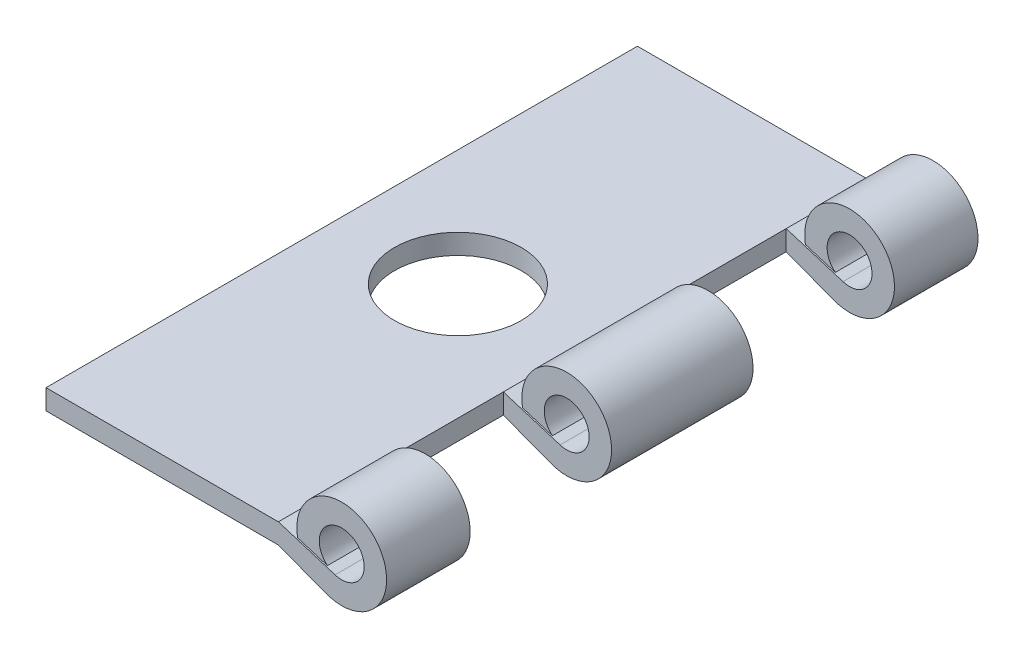
ISO-10303-21;
HEADER;
FILE_DESCRIPTION(('STEP AP214'),'2;1');
FILE_NAME('part.step','',(''),(''),'','','');
FILE_SCHEMA(('AUTOMOTIVE_DESIGN { 1 0 10303 214 1 1 1 1 }'));
ENDSEC;
DATA;
#1=APPLICATION_CONTEXT('core data for automotive mechanical design processes');
#2=APPLICATION_PROTOCOL_DEFINITION('international standard','automotive_design',2000,#1);
#3=PRODUCT_CONTEXT('',#1,'mechanical');
#4=PRODUCT('Part','Part','',(#3));
#5=PRODUCT_RELATED_PRODUCT_CATEGORY('part','',(#4));
#6=PRODUCT_DEFINITION_FORMATION('','',#4);
#7=PRODUCT_DEFINITION_CONTEXT('part definition',#1,'design');
#8=PRODUCT_DEFINITION('design','',#6,#7);
#9=PRODUCT_DEFINITION_SHAPE('','',#8);
#10=(LENGTH_UNIT() NAMED_UNIT(*) SI_UNIT(.MILLI.,.METRE.));
#11=(NAMED_UNIT(*) PLANE_ANGLE_UNIT() SI_UNIT($,.RADIAN.));
#12=(NAMED_UNIT(*) SI_UNIT($,.STERADIAN.) SOLID_ANGLE_UNIT());
#13=UNCERTAINTY_MEASURE_WITH_UNIT(LENGTH_MEASURE(1.E-05),#10,'distance_accuracy_value','');
#14=(GEOMETRIC_REPRESENTATION_CONTEXT(3) GLOBAL_UNCERTAINTY_ASSIGNED_CONTEXT((#13)) GLOBAL_UNIT_ASSIGNED_CONTEXT((#10,
#11,#12)) REPRESENTATION_CONTEXT('',''));
#15=CARTESIAN_POINT('',(0.,0.,0.));
#16=DIRECTION('',(0.,0.,1.));
#17=DIRECTION('',(1.,0.,0.));
#18=AXIS2_PLACEMENT_3D('',#15,#16,#17);
#19=CARTESIAN_POINT('',(18.8515625,0.,88.9));
#20=DIRECTION('',(0.,0.,-1.));
#21=DIRECTION('',(-1.,0.,0.));
#22=AXIS2_PLACEMENT_3D('',#19,#20,#21);
#23=CYLINDRICAL_SURFACE('',#22,6.746875);
#24=CARTESIAN_POINT('',(18.8515625,0.,55.0798999999995));
#25=DIRECTION('',(0.,0.,-1.));
#26=DIRECTION('',(-1.,0.,0.));
#27=AXIS2_PLACEMENT_3D('',#24,#25,#26);
#28=CIRCLE('',#27,6.746875);
#29=CARTESIAN_POINT('',(12.214407068558,-1.21181271016004,55.0798999999996));
#30=VERTEX_POINT('',#29);
#31=CARTESIAN_POINT('',(16.4616953830601,-6.3094260776234,55.0798999999995));
#32=VERTEX_POINT('',#31);
#33=EDGE_CURVE('E358',#30,#32,#28,.T.);
#34=ORIENTED_EDGE('',*,*,#33,.T.);
#35=DIRECTION('',(0.,0.,-1.));
#36=VECTOR('',#35,1.);
#37=CARTESIAN_POINT('',(16.4616953830601,-6.3094260776234,88.9));
#38=LINE('',#37,#36);
#39=CARTESIAN_POINT('',(16.4616953830601,-6.3094260776234,33.8200999999996));
#40=VERTEX_POINT('',#39);
#41=EDGE_CURVE('E254',#32,#40,#38,.T.);
#42=ORIENTED_EDGE('',*,*,#41,.T.);
#43=CARTESIAN_POINT('',(18.8515625,0.,33.8200999999995));
#44=DIRECTION('',(0.,0.,1.));
#45=DIRECTION('',(1.,0.,0.));
#46=AXIS2_PLACEMENT_3D('',#43,#44,#45);
#47=CIRCLE('',#46,6.746875);
#48=CARTESIAN_POINT('',(12.214407068558,-1.21181271016004,33.8200999999996));
#49=VERTEX_POINT('',#48);
#50=EDGE_CURVE('E54',#40,#49,#47,.T.);
#51=ORIENTED_EDGE('',*,*,#50,.T.);
#52=DIRECTION('',(0.,0.,-1.));
#53=VECTOR('',#52,1.);
#54=CARTESIAN_POINT('',(12.214407068558,-1.21181271016004,88.9));
#55=LINE('',#54,#53);
#56=EDGE_CURVE('E238',#30,#49,#55,.T.);
#57=ORIENTED_EDGE('',*,*,#56,.F.);
#58=EDGE_LOOP('',(#34,#42,#51,#57));
#59=FACE_BOUND('',#58,.T.);
#60=ADVANCED_FACE('F39',(#59),#23,.T.);
#61=CARTESIAN_POINT('',(18.8515625,0.,12.5602999999995));
#62=DIRECTION('',(0.,0.,-1.));
#63=DIRECTION('',(-1.,0.,0.));
#64=AXIS2_PLACEMENT_3D('',#61,#62,#63);
#65=CIRCLE('',#64,6.746875);
#66=CARTESIAN_POINT('',(12.214407068558,-1.21181271016004,12.5602999999996));
#67=VERTEX_POINT('',#66);
#68=CARTESIAN_POINT('',(16.4616953830601,-6.3094260776234,12.5602999999995));
#69=VERTEX_POINT('',#68);
#70=EDGE_CURVE('E336',#67,#69,#65,.T.);
#71=ORIENTED_EDGE('',*,*,#70,.T.);
#72=CARTESIAN_POINT('',(16.4616953830601,-6.3094260776234,0.));
#73=VERTEX_POINT('',#72);
#74=EDGE_CURVE('E255',#69,#73,#38,.T.);
#75=ORIENTED_EDGE('',*,*,#74,.T.);
#76=CARTESIAN_POINT('',(18.8515625,0.,0.));
#77=DIRECTION('',(0.,0.,1.));
#78=DIRECTION('',(1.,0.,0.));
#79=AXIS2_PLACEMENT_3D('',#76,#77,#78);
#80=CIRCLE('',#79,6.746875);
#81=CARTESIAN_POINT('',(12.214407068558,-1.21181271016004,0.));
#82=VERTEX_POINT('',#81);
#83=EDGE_CURVE('E268',#73,#82,#80,.T.);
#84=ORIENTED_EDGE('',*,*,#83,.T.);
#85=EDGE_CURVE('E235',#67,#82,#55,.T.);
#86=ORIENTED_EDGE('',*,*,#85,.F.);
#87=EDGE_LOOP('',(#71,#75,#84,#86));
#88=FACE_BOUND('',#87,.T.);
#89=ADVANCED_FACE('F395',(#88),#23,.T.);
#90=CARTESIAN_POINT('',(12.214407068558,-1.21181271016004,88.9));
#91=DIRECTION('',(0.295573710543315,0.955319936793772,0.));
#92=DIRECTION('',(-0.955319936793772,0.295573710543315,0.));
#93=AXIS2_PLACEMENT_3D('',#90,#91,#92);
#94=PLANE('',#93);
#95=DIRECTION('',(0.,0.,-1.));
#96=VECTOR('',#95,1.);
#97=CARTESIAN_POINT('',(16.7027092545924,-2.60048270444304,88.9));
#98=LINE('',#97,#96);
#99=CARTESIAN_POINT('',(16.7027092545924,-2.60048270444304,55.0798999999995));
#100=VERTEX_POINT('',#99);
#101=CARTESIAN_POINT('',(16.7027092545924,-2.60048270444304,33.8200999999995));
#102=VERTEX_POINT('',#101);
#103=EDGE_CURVE('E236',#100,#102,#98,.T.);
#104=ORIENTED_EDGE('',*,*,#103,.F.);
#105=DIRECTION('',(-0.955319936793772,0.295573710543315,0.));
#106=VECTOR('',#105,1.);
#107=CARTESIAN_POINT('',(12.2144070685577,-1.21181271015994,55.0798999999996));
#108=LINE('',#107,#106);
#109=EDGE_CURVE('E360',#100,#30,#108,.T.);
#110=ORIENTED_EDGE('',*,*,#109,.T.);
#111=ORIENTED_EDGE('',*,*,#56,.T.);
#112=DIRECTION('',(0.955319936793772,-0.295573710543315,0.));
#113=VECTOR('',#112,1.);
#114=CARTESIAN_POINT('',(12.2144070685575,-1.21181271015987,33.8200999999996));
#115=LINE('',#114,#113);
#116=EDGE_CURVE('E322',#49,#102,#115,.T.);
#117=ORIENTED_EDGE('',*,*,#116,.T.);
#118=EDGE_LOOP('',(#104,#110,#111,#117));
#119=FACE_BOUND('',#118,.T.);
#120=ADVANCED_FACE('F385',(#119),#94,.F.);
#121=CARTESIAN_POINT('',(16.7027092545924,-2.60048270444304,12.5602999999995));
#122=VERTEX_POINT('',#121);
#123=CARTESIAN_POINT('',(16.7027092545924,-2.60048270444304,0.));
#124=VERTEX_POINT('',#123);
#125=EDGE_CURVE('E230',#122,#124,#98,.T.);
#126=ORIENTED_EDGE('',*,*,#125,.F.);
#127=DIRECTION('',(-0.955319936793772,0.295573710543315,0.));
#128=VECTOR('',#127,1.);
#129=CARTESIAN_POINT('',(12.2144070685573,-1.21181271015982,12.5602999999996));
#130=LINE('',#129,#128);
#131=EDGE_CURVE('E338',#122,#67,#130,.T.);
#132=ORIENTED_EDGE('',*,*,#131,.T.);
#133=ORIENTED_EDGE('',*,*,#85,.T.);
#134=DIRECTION('',(0.955319936793772,-0.295573710543315,0.));
#135=VECTOR('',#134,1.);
#136=CARTESIAN_POINT('',(12.214407068558,-1.21181271016004,0.));
#137=LINE('',#136,#135);
#138=EDGE_CURVE('E270',#82,#124,#137,.T.);
#139=ORIENTED_EDGE('',*,*,#138,.T.);
#140=EDGE_LOOP('',(#126,#132,#133,#139));
#141=FACE_BOUND('',#140,.T.);
#142=ADVANCED_FACE('F386',(#141),#94,.F.);
#143=CARTESIAN_POINT('',(18.8515625,0.,88.9));
#144=DIRECTION('',(0.,0.,-1.));
#145=DIRECTION('',(-1.,0.,0.));
#146=AXIS2_PLACEMENT_3D('',#143,#144,#145);
#147=CYLINDRICAL_SURFACE('',#146,3.3734375);
#148=DIRECTION('',(0.,0.,-1.));
#149=VECTOR('',#148,1.);
#150=CARTESIAN_POINT('',(17.854463060839,-3.22271209927774,88.9));
#151=LINE('',#150,#149);
#152=CARTESIAN_POINT('',(17.854463060839,-3.22271209927774,55.0798999999995));
#153=VERTEX_POINT('',#152);
#154=CARTESIAN_POINT('',(17.854463060839,-3.22271209927774,33.8200999999995));
#155=VERTEX_POINT('',#154);
#156=EDGE_CURVE('E231',#153,#155,#151,.T.);
#157=ORIENTED_EDGE('',*,*,#156,.F.);
#158=CARTESIAN_POINT('',(18.8515625,0.,55.0798999999995));
#159=DIRECTION('',(0.,0.,-1.));
#160=DIRECTION('',(-1.,0.,0.));
#161=AXIS2_PLACEMENT_3D('',#158,#159,#160);
#162=CIRCLE('',#161,3.3734375);
#163=EDGE_CURVE('E363',#153,#100,#162,.F.);
#164=ORIENTED_EDGE('',*,*,#163,.T.);
#165=ORIENTED_EDGE('',*,*,#103,.T.);
#166=CARTESIAN_POINT('',(18.8515625,0.,33.8200999999995));
#167=DIRECTION('',(0.,0.,1.));
#168=DIRECTION('',(1.,0.,0.));
#169=AXIS2_PLACEMENT_3D('',#166,#167,#168);
#170=CIRCLE('',#169,3.3734375);
#171=EDGE_CURVE('E331',#102,#155,#170,.F.);
#172=ORIENTED_EDGE('',*,*,#171,.T.);
#173=EDGE_LOOP('',(#157,#164,#165,#172));
#174=FACE_BOUND('',#173,.T.);
#175=ADVANCED_FACE('F392',(#174),#147,.F.);
#176=CARTESIAN_POINT('',(17.854463060839,-3.22271209927774,12.5602999999995));
#177=VERTEX_POINT('',#176);
#178=CARTESIAN_POINT('',(17.854463060839,-3.22271209927774,0.));
#179=VERTEX_POINT('',#178);
#180=EDGE_CURVE('E225',#177,#179,#151,.T.);
#181=ORIENTED_EDGE('',*,*,#180,.F.);
#182=CARTESIAN_POINT('',(18.8515625,0.,12.5602999999995));
#183=DIRECTION('',(0.,0.,-1.));
#184=DIRECTION('',(-1.,0.,0.));
#185=AXIS2_PLACEMENT_3D('',#182,#183,#184);
#186=CIRCLE('',#185,3.3734375);
#187=EDGE_CURVE('E341',#177,#122,#186,.F.);
#188=ORIENTED_EDGE('',*,*,#187,.T.);
#189=ORIENTED_EDGE('',*,*,#125,.T.);
#190=CARTESIAN_POINT('',(18.8515625,0.,0.));
#191=DIRECTION('',(0.,0.,-1.));
#192=DIRECTION('',(1.,0.,0.));
#193=AXIS2_PLACEMENT_3D('',#190,#191,#192);
#194=CIRCLE('',#193,3.3734375);
#195=EDGE_CURVE('E274',#124,#179,#194,.T.);
#196=ORIENTED_EDGE('',*,*,#195,.T.);
#197=EDGE_LOOP('',(#181,#188,#189,#196));
#198=FACE_BOUND('',#197,.T.);
#199=ADVANCED_FACE('F393',(#198),#147,.F.);
#200=CARTESIAN_POINT('',(9.32656249999999,-0.5842,88.9));
#201=DIRECTION('',(-0.295573710543315,-0.955319936793772,0.));
#202=DIRECTION('',(0.955319936793772,-0.295573710543315,0.));
#203=AXIS2_PLACEMENT_3D('',#200,#201,#202);
#204=PLANE('',#203);
#205=DIRECTION('',(0.,0.,-1.));
#206=VECTOR('',#205,1.);
#207=CARTESIAN_POINT('',(9.32656249999999,-0.5842,88.9));
#208=LINE('',#207,#206);
#209=CARTESIAN_POINT('',(9.3265625000001,-0.5842,55.0798999999996));
#210=VERTEX_POINT('',#209);
#211=CARTESIAN_POINT('',(9.32656249999985,-0.5842,33.8200999999996));
#212=VERTEX_POINT('',#211);
#213=EDGE_CURVE('E226',#210,#212,#208,.T.);
#214=ORIENTED_EDGE('',*,*,#213,.F.);
#215=DIRECTION('',(0.955319936793772,-0.295573710543315,0.));
#216=VECTOR('',#215,1.);
#217=CARTESIAN_POINT('',(9.32656249999968,-0.584199999999902,55.0798999999996));
#218=LINE('',#217,#216);
#219=EDGE_CURVE('E320',#210,#153,#218,.T.);
#220=ORIENTED_EDGE('',*,*,#219,.T.);
#221=ORIENTED_EDGE('',*,*,#156,.T.);
#222=DIRECTION('',(-0.955319936793772,0.295573710543315,0.));
#223=VECTOR('',#222,1.);
#224=CARTESIAN_POINT('',(9.32656249999946,-0.584199999999834,33.8200999999996));
#225=LINE('',#224,#223);
#226=EDGE_CURVE('E334',#155,#212,#225,.T.);
#227=ORIENTED_EDGE('',*,*,#226,.T.);
#228=EDGE_LOOP('',(#214,#220,#221,#227));
#229=FACE_BOUND('',#228,.T.);
#230=ADVANCED_FACE('F423',(#229),#204,.F.);
#231=CARTESIAN_POINT('',(9.32656249999964,-0.5842,12.5602999999996));
#232=VERTEX_POINT('',#231);
#233=CARTESIAN_POINT('',(9.32656249999999,-0.5842,0.));
#234=VERTEX_POINT('',#233);
#235=EDGE_CURVE('E221',#232,#234,#208,.T.);
#236=ORIENTED_EDGE('',*,*,#235,.F.);
#237=DIRECTION('',(0.955319936793772,-0.295573710543315,0.));
#238=VECTOR('',#237,1.);
#239=CARTESIAN_POINT('',(9.32656249999928,-0.584199999999779,12.5602999999996));
#240=LINE('',#239,#238);
#241=EDGE_CURVE('E344',#232,#177,#240,.T.);
#242=ORIENTED_EDGE('',*,*,#241,.T.);
#243=ORIENTED_EDGE('',*,*,#180,.T.);
#244=DIRECTION('',(-0.955319936793772,0.295573710543315,0.));
#245=VECTOR('',#244,1.);
#246=CARTESIAN_POINT('',(9.32656249999999,-0.5842,0.));
#247=LINE('',#246,#245);
#248=EDGE_CURVE('E277',#179,#234,#247,.T.);
#249=ORIENTED_EDGE('',*,*,#248,.T.);
#250=EDGE_LOOP('',(#236,#242,#243,#249));
#251=FACE_BOUND('',#250,.T.);
#252=ADVANCED_FACE('F422',(#251),#204,.F.);
#253=CARTESIAN_POINT('',(9.3265625,-3.6068,88.9));
#254=DIRECTION('',(0.354218377684474,0.935162734988183,0.));
#255=DIRECTION('',(-0.935162734988183,0.354218377684474,0.));
#256=AXIS2_PLACEMENT_3D('',#253,#254,#255);
#257=PLANE('',#256);
#258=ORIENTED_EDGE('',*,*,#41,.F.);
#259=DIRECTION('',(-0.935162734988183,0.354218377684474,0.));
#260=VECTOR('',#259,1.);
#261=CARTESIAN_POINT('',(9.3265624999997,-3.60679999999989,55.0798999999996));
#262=LINE('',#261,#260);
#263=CARTESIAN_POINT('',(9.3265625000001,-3.60680000000004,55.0798999999996));
#264=VERTEX_POINT('',#263);
#265=EDGE_CURVE('E11',#32,#264,#262,.T.);
#266=ORIENTED_EDGE('',*,*,#265,.T.);
#267=DIRECTION('',(0.,0.,-1.));
#268=VECTOR('',#267,1.);
#269=CARTESIAN_POINT('',(9.3265625,-3.6068,88.9));
#270=LINE('',#269,#268);
#271=CARTESIAN_POINT('',(9.32656249999985,-3.60679999999995,33.8200999999996));
#272=VERTEX_POINT('',#271);
#273=EDGE_CURVE('E203',#264,#272,#270,.T.);
#274=ORIENTED_EDGE('',*,*,#273,.T.);
#275=DIRECTION('',(0.935162734988183,-0.354218377684474,0.));
#276=VECTOR('',#275,1.);
#277=CARTESIAN_POINT('',(9.32656249999949,-3.60679999999981,33.8200999999996));
#278=LINE('',#277,#276);
#279=EDGE_CURVE('E174',#272,#40,#278,.T.);
#280=ORIENTED_EDGE('',*,*,#279,.T.);
#281=EDGE_LOOP('',(#258,#266,#274,#280));
#282=FACE_BOUND('',#281,.T.);
#283=ADVANCED_FACE('F206',(#282),#257,.F.);
#284=ORIENTED_EDGE('',*,*,#74,.F.);
#285=DIRECTION('',(-0.935162734988183,0.354218377684474,0.));
#286=VECTOR('',#285,1.);
#287=CARTESIAN_POINT('',(9.32656249999932,-3.60679999999974,12.5602999999996));
#288=LINE('',#287,#286);
#289=CARTESIAN_POINT('',(9.32656249999964,-3.60679999999987,12.5602999999996));
#290=VERTEX_POINT('',#289);
#291=EDGE_CURVE('E183',#69,#290,#288,.T.);
#292=ORIENTED_EDGE('',*,*,#291,.T.);
#293=CARTESIAN_POINT('',(9.3265625,-3.6068,0.));
#294=VERTEX_POINT('',#293);
#295=EDGE_CURVE('E204',#290,#294,#270,.T.);
#296=ORIENTED_EDGE('',*,*,#295,.T.);
#297=DIRECTION('',(0.935162734988183,-0.354218377684474,0.));
#298=VECTOR('',#297,1.);
#299=CARTESIAN_POINT('',(9.3265625,-3.6068,0.));
#300=LINE('',#299,#298);
#301=EDGE_CURVE('E285',#294,#73,#300,.T.);
#302=ORIENTED_EDGE('',*,*,#301,.T.);
#303=EDGE_LOOP('',(#284,#292,#296,#302));
#304=FACE_BOUND('',#303,.T.);
#305=ADVANCED_FACE('F394',(#304),#257,.F.);
#306=CARTESIAN_POINT('',(18.8515625,0.,76.3396999999995));
#307=DIRECTION('',(0.,0.,1.));
#308=DIRECTION('',(1.,0.,0.));
#309=AXIS2_PLACEMENT_3D('',#306,#307,#308);
#310=CIRCLE('',#309,6.746875);
#311=CARTESIAN_POINT('',(16.4616953830601,-6.3094260776234,76.3396999999996));
#312=VERTEX_POINT('',#311);
#313=CARTESIAN_POINT('',(12.214407068558,-1.21181271016004,76.3396999999996));
#314=VERTEX_POINT('',#313);
#315=EDGE_CURVE('E62',#312,#314,#310,.T.);
#316=ORIENTED_EDGE('',*,*,#315,.T.);
#317=CARTESIAN_POINT('',(12.214407068558,-1.21181271016004,88.9));
#318=VERTEX_POINT('',#317);
#319=EDGE_CURVE('E184',#318,#314,#55,.T.);
#320=ORIENTED_EDGE('',*,*,#319,.F.);
#321=CARTESIAN_POINT('',(18.8515625,0.,88.9));
#322=DIRECTION('',(0.,0.,1.));
#323=DIRECTION('',(1.,0.,0.));
#324=AXIS2_PLACEMENT_3D('',#321,#322,#323);
#325=CIRCLE('',#324,6.746875);
#326=CARTESIAN_POINT('',(16.4616953830601,-6.3094260776234,88.9));
#327=VERTEX_POINT('',#326);
#328=EDGE_CURVE('E253',#327,#318,#325,.T.);
#329=ORIENTED_EDGE('',*,*,#328,.F.);
#330=EDGE_CURVE('E214',#327,#312,#38,.T.);
#331=ORIENTED_EDGE('',*,*,#330,.T.);
#332=EDGE_LOOP('',(#316,#320,#329,#331));
#333=FACE_BOUND('',#332,.T.);
#334=ADVANCED_FACE('F41',(#333),#23,.T.);
#335=ORIENTED_EDGE('',*,*,#319,.T.);
#336=DIRECTION('',(0.955319936793772,-0.295573710543315,0.));
#337=VECTOR('',#336,1.);
#338=CARTESIAN_POINT('',(12.2144070685579,-1.21181271016,76.3396999999996));
#339=LINE('',#338,#337);
#340=CARTESIAN_POINT('',(16.7027092545924,-2.60048270444304,76.3396999999996));
#341=VERTEX_POINT('',#340);
#342=EDGE_CURVE('E349',#314,#341,#339,.T.);
#343=ORIENTED_EDGE('',*,*,#342,.T.);
#344=CARTESIAN_POINT('',(16.7027092545924,-2.60048270444304,88.9));
#345=VERTEX_POINT('',#344);
#346=EDGE_CURVE('E232',#345,#341,#98,.T.);
#347=ORIENTED_EDGE('',*,*,#346,.F.);
#348=DIRECTION('',(0.955319936793772,-0.295573710543315,0.));
#349=VECTOR('',#348,1.);
#350=CARTESIAN_POINT('',(12.214407068558,-1.21181271016004,88.9));
#351=LINE('',#350,#349);
#352=EDGE_CURVE('E289',#318,#345,#351,.T.);
#353=ORIENTED_EDGE('',*,*,#352,.F.);
#354=EDGE_LOOP('',(#335,#343,#347,#353));
#355=FACE_BOUND('',#354,.T.);
#356=ADVANCED_FACE('F383',(#355),#94,.F.);
#357=ORIENTED_EDGE('',*,*,#346,.T.);
#358=CARTESIAN_POINT('',(18.8515625,0.,76.3396999999995));
#359=DIRECTION('',(0.,0.,1.));
#360=DIRECTION('',(1.,0.,0.));
#361=AXIS2_PLACEMENT_3D('',#358,#359,#360);
#362=CIRCLE('',#361,3.3734375);
#363=CARTESIAN_POINT('',(17.854463060839,-3.22271209927774,76.3396999999995));
#364=VERTEX_POINT('',#363);
#365=EDGE_CURVE('E352',#341,#364,#362,.F.);
#366=ORIENTED_EDGE('',*,*,#365,.T.);
#367=CARTESIAN_POINT('',(17.854463060839,-3.22271209927774,88.9));
#368=VERTEX_POINT('',#367);
#369=EDGE_CURVE('E227',#368,#364,#151,.T.);
#370=ORIENTED_EDGE('',*,*,#369,.F.);
#371=CARTESIAN_POINT('',(18.8515625,0.,88.9));
#372=DIRECTION('',(0.,0.,-1.));
#373=DIRECTION('',(1.,0.,0.));
#374=AXIS2_PLACEMENT_3D('',#371,#372,#373);
#375=CIRCLE('',#374,3.3734375);
#376=EDGE_CURVE('E291',#345,#368,#375,.T.);
#377=ORIENTED_EDGE('',*,*,#376,.F.);
#378=EDGE_LOOP('',(#357,#366,#370,#377));
#379=FACE_BOUND('',#378,.T.);
#380=ADVANCED_FACE('F380',(#379),#147,.F.);
#381=ORIENTED_EDGE('',*,*,#369,.T.);
#382=DIRECTION('',(-0.955319936793772,0.295573710543315,0.));
#383=VECTOR('',#382,1.);
#384=CARTESIAN_POINT('',(9.32656249999988,-0.584199999999964,76.3396999999996));
#385=LINE('',#384,#383);
#386=CARTESIAN_POINT('',(9.32656250000031,-0.5842,76.3396999999996));
#387=VERTEX_POINT('',#386);
#388=EDGE_CURVE('E355',#364,#387,#385,.T.);
#389=ORIENTED_EDGE('',*,*,#388,.T.);
#390=CARTESIAN_POINT('',(9.32656249999999,-0.5842,88.9));
#391=VERTEX_POINT('',#390);
#392=EDGE_CURVE('E222',#391,#387,#208,.T.);
#393=ORIENTED_EDGE('',*,*,#392,.F.);
#394=DIRECTION('',(-0.955319936793772,0.295573710543315,0.));
#395=VECTOR('',#394,1.);
#396=CARTESIAN_POINT('',(9.32656249999999,-0.5842,88.9));
#397=LINE('',#396,#395);
#398=EDGE_CURVE('E297',#368,#391,#397,.T.);
#399=ORIENTED_EDGE('',*,*,#398,.F.);
#400=EDGE_LOOP('',(#381,#389,#393,#399));
#401=FACE_BOUND('',#400,.T.);
#402=ADVANCED_FACE('F375',(#401),#204,.F.);
#403=CARTESIAN_POINT('',(-25.5984375,-0.5842,88.9));
#404=DIRECTION('',(0.,-1.,0.));
#405=DIRECTION('',(0.,0.,-1.));
#406=AXIS2_PLACEMENT_3D('',#403,#404,#405);
#407=PLANE('',#406);
#408=CARTESIAN_POINT('',(-8.13593750000001,-0.584199999999993,44.4499999999996));
#409=DIRECTION('',(0.,-1.,0.));
#410=DIRECTION('',(0.,0.,-1.));
#411=AXIS2_PLACEMENT_3D('',#408,#409,#410);
#412=CIRCLE('',#411,9.525);
#413=CARTESIAN_POINT('',(-8.13593750000001,-0.584199999999993,34.9249999999996));
#414=VERTEX_POINT('',#413);
#415=EDGE_CURVE('E195',#414,#414,#412,.T.);
#416=ORIENTED_EDGE('',*,*,#415,.T.);
#417=EDGE_LOOP('',(#416));
#418=FACE_BOUND('',#417,.T.);
#419=DIRECTION('',(-1.,0.,0.));
#420=VECTOR('',#419,1.);
#421=CARTESIAN_POINT('',(-25.5984375,-0.5842,0.));
#422=LINE('',#421,#420);
#423=CARTESIAN_POINT('',(-25.5984375,-0.5842,0.));
#424=VERTEX_POINT('',#423);
#425=EDGE_CURVE('E280',#234,#424,#422,.T.);
#426=ORIENTED_EDGE('',*,*,#425,.T.);
#427=DIRECTION('',(0.,0.,-1.));
#428=VECTOR('',#427,1.);
#429=CARTESIAN_POINT('',(-25.5984375,-0.5842,88.9));
#430=LINE('',#429,#428);
#431=CARTESIAN_POINT('',(-25.5984375,-0.5842,88.9));
#432=VERTEX_POINT('',#431);
#433=EDGE_CURVE('E218',#432,#424,#430,.T.);
#434=ORIENTED_EDGE('',*,*,#433,.F.);
#435=DIRECTION('',(-1.,0.,0.));
#436=VECTOR('',#435,1.);
#437=CARTESIAN_POINT('',(-25.5984375,-0.5842,88.9));
#438=LINE('',#437,#436);
#439=EDGE_CURVE('E299',#391,#432,#438,.T.);
#440=ORIENTED_EDGE('',*,*,#439,.F.);
#441=ORIENTED_EDGE('',*,*,#392,.T.);
#442=DIRECTION('',(0.,0.,-1.));
#443=VECTOR('',#442,1.);
#444=CARTESIAN_POINT('',(9.32656250000043,-0.5842,88.8999999999997));
#445=LINE('',#444,#443);
#446=EDGE_CURVE('E271',#387,#210,#445,.T.);
#447=ORIENTED_EDGE('',*,*,#446,.T.);
#448=ORIENTED_EDGE('',*,*,#213,.T.);
#449=DIRECTION('',(0.,0.,-1.));
#450=VECTOR('',#449,1.);
#451=CARTESIAN_POINT('',(9.32656250000039,-0.5842,88.8999999999997));
#452=LINE('',#451,#450);
#453=EDGE_CURVE('E193',#212,#232,#452,.T.);
#454=ORIENTED_EDGE('',*,*,#453,.T.);
#455=ORIENTED_EDGE('',*,*,#235,.T.);
#456=EDGE_LOOP('',(#426,#434,#440,#441,#447,#448,#454,#455));
#457=FACE_BOUND('',#456,.T.);
#458=ADVANCED_FACE('F371',(#418,#457),#407,.F.);
#459=CARTESIAN_POINT('',(-25.5984375,-0.5842,88.9));
#460=DIRECTION('',(1.,0.,0.));
#461=DIRECTION('',(0.,0.,-1.));
#462=AXIS2_PLACEMENT_3D('',#459,#460,#461);
#463=PLANE('',#462);
#464=DIRECTION('',(0.,-1.,0.));
#465=VECTOR('',#464,1.);
#466=CARTESIAN_POINT('',(-25.5984375,-0.5842,0.));
#467=LINE('',#466,#465);
#468=CARTESIAN_POINT('',(-25.5984375,-3.6068,0.));
#469=VERTEX_POINT('',#468);
#470=EDGE_CURVE('E282',#424,#469,#467,.T.);
#471=ORIENTED_EDGE('',*,*,#470,.T.);
#472=DIRECTION('',(0.,0.,-1.));
#473=VECTOR('',#472,1.);
#474=CARTESIAN_POINT('',(-25.5984375,-3.6068,88.9));
#475=LINE('',#474,#473);
#476=CARTESIAN_POINT('',(-25.5984375,-3.6068,88.9));
#477=VERTEX_POINT('',#476);
#478=EDGE_CURVE('E213',#477,#469,#475,.T.);
#479=ORIENTED_EDGE('',*,*,#478,.F.);
#480=DIRECTION('',(0.,-1.,0.));
#481=VECTOR('',#480,1.);
#482=CARTESIAN_POINT('',(-25.5984375,-0.5842,88.9));
#483=LINE('',#482,#481);
#484=EDGE_CURVE('E264',#432,#477,#483,.T.);
#485=ORIENTED_EDGE('',*,*,#484,.F.);
#486=ORIENTED_EDGE('',*,*,#433,.T.);
#487=EDGE_LOOP('',(#471,#479,#485,#486));
#488=FACE_BOUND('',#487,.T.);
#489=ADVANCED_FACE('F307',(#488),#463,.F.);
#490=CARTESIAN_POINT('',(-25.5984375,-3.6068,88.9));
#491=DIRECTION('',(0.,1.,0.));
#492=DIRECTION('',(0.,0.,1.));
#493=AXIS2_PLACEMENT_3D('',#490,#491,#492);
#494=PLANE('',#493);
#495=CARTESIAN_POINT('',(-8.13593750000001,-3.6068,44.4499999999996));
#496=DIRECTION('',(0.,-1.,0.));
#497=DIRECTION('',(0.,0.,-1.));
#498=AXIS2_PLACEMENT_3D('',#495,#496,#497);
#499=CIRCLE('',#498,9.525);
#500=CARTESIAN_POINT('',(-8.13593750000001,-3.6068,34.9249999999996));
#501=VERTEX_POINT('',#500);
#502=EDGE_CURVE('E467',#501,#501,#499,.T.);
#503=ORIENTED_EDGE('',*,*,#502,.F.);
#504=EDGE_LOOP('',(#503));
#505=FACE_BOUND('',#504,.T.);
#506=DIRECTION('',(1.,0.,0.));
#507=VECTOR('',#506,1.);
#508=CARTESIAN_POINT('',(-25.5984375,-3.6068,0.));
#509=LINE('',#508,#507);
#510=EDGE_CURVE('E284',#469,#294,#509,.T.);
#511=ORIENTED_EDGE('',*,*,#510,.T.);
#512=ORIENTED_EDGE('',*,*,#295,.F.);
#513=EDGE_CURVE('E190',#272,#290,#270,.T.);
#514=ORIENTED_EDGE('',*,*,#513,.F.);
#515=ORIENTED_EDGE('',*,*,#273,.F.);
#516=CARTESIAN_POINT('',(9.32656250000031,-3.60680000000013,76.3396999999996));
#517=VERTEX_POINT('',#516);
#518=EDGE_CURVE('E208',#517,#264,#270,.T.);
#519=ORIENTED_EDGE('',*,*,#518,.F.);
#520=CARTESIAN_POINT('',(9.3265625,-3.6068,88.9));
#521=VERTEX_POINT('',#520);
#522=EDGE_CURVE('E209',#521,#517,#270,.T.);
#523=ORIENTED_EDGE('',*,*,#522,.F.);
#524=DIRECTION('',(1.,0.,0.));
#525=VECTOR('',#524,1.);
#526=CARTESIAN_POINT('',(-25.5984375,-3.6068,88.9));
#527=LINE('',#526,#525);
#528=EDGE_CURVE('E261',#477,#521,#527,.T.);
#529=ORIENTED_EDGE('',*,*,#528,.F.);
#530=ORIENTED_EDGE('',*,*,#478,.T.);
#531=EDGE_LOOP('',(#511,#512,#514,#515,#519,#523,#529,#530));
#532=FACE_BOUND('',#531,.T.);
#533=ADVANCED_FACE('F201',(#505,#532),#494,.F.);
#534=ORIENTED_EDGE('',*,*,#522,.T.);
#535=DIRECTION('',(0.935162734988183,-0.354218377684474,0.));
#536=VECTOR('',#535,1.);
#537=CARTESIAN_POINT('',(9.32656249999989,-3.60679999999996,76.3396999999996));
#538=LINE('',#537,#536);
#539=EDGE_CURVE('E47',#517,#312,#538,.T.);
#540=ORIENTED_EDGE('',*,*,#539,.T.);
#541=ORIENTED_EDGE('',*,*,#330,.F.);
#542=DIRECTION('',(0.935162734988183,-0.354218377684474,0.));
#543=VECTOR('',#542,1.);
#544=CARTESIAN_POINT('',(9.3265625,-3.6068,88.9));
#545=LINE('',#544,#543);
#546=EDGE_CURVE('E256',#521,#327,#545,.T.);
#547=ORIENTED_EDGE('',*,*,#546,.F.);
#548=EDGE_LOOP('',(#534,#540,#541,#547));
#549=FACE_BOUND('',#548,.T.);
#550=ADVANCED_FACE('F244',(#549),#257,.F.);
#551=CARTESIAN_POINT('',(18.8515625,0.,88.9));
#552=DIRECTION('',(0.,0.,1.));
#553=DIRECTION('',(1.,0.,0.));
#554=AXIS2_PLACEMENT_3D('',#551,#552,#553);
#555=PLANE('',#554);
#556=ORIENTED_EDGE('',*,*,#328,.T.);
#557=ORIENTED_EDGE('',*,*,#352,.T.);
#558=ORIENTED_EDGE('',*,*,#376,.T.);
#559=ORIENTED_EDGE('',*,*,#398,.T.);
#560=ORIENTED_EDGE('',*,*,#439,.T.);
#561=ORIENTED_EDGE('',*,*,#484,.T.);
#562=ORIENTED_EDGE('',*,*,#528,.T.);
#563=ORIENTED_EDGE('',*,*,#546,.T.);
#564=EDGE_LOOP('',(#556,#557,#558,#559,#560,#561,#562,#563));
#565=FACE_BOUND('',#564,.T.);
#566=ADVANCED_FACE('F302',(#565),#555,.T.);
#567=CARTESIAN_POINT('',(18.8515625,0.,0.));
#568=DIRECTION('',(0.,0.,1.));
#569=DIRECTION('',(1.,0.,0.));
#570=AXIS2_PLACEMENT_3D('',#567,#568,#569);
#571=PLANE('',#570);
#572=ORIENTED_EDGE('',*,*,#83,.F.);
#573=ORIENTED_EDGE('',*,*,#301,.F.);
#574=ORIENTED_EDGE('',*,*,#510,.F.);
#575=ORIENTED_EDGE('',*,*,#470,.F.);
#576=ORIENTED_EDGE('',*,*,#425,.F.);
#577=ORIENTED_EDGE('',*,*,#248,.F.);
#578=ORIENTED_EDGE('',*,*,#195,.F.);
#579=ORIENTED_EDGE('',*,*,#138,.F.);
#580=EDGE_LOOP('',(#572,#573,#574,#575,#576,#577,#578,#579));
#581=FACE_BOUND('',#580,.T.);
#582=ADVANCED_FACE('F418',(#581),#571,.F.);
#583=CARTESIAN_POINT('',(9.32656249999985,-45.0342,33.8200999999996));
#584=DIRECTION('',(-1.,0.,0.));
#585=DIRECTION('',(0.,0.,1.));
#586=AXIS2_PLACEMENT_3D('',#583,#584,#585);
#587=PLANE('',#586);
#588=DIRECTION('',(0.,1.,0.));
#589=VECTOR('',#588,1.);
#590=CARTESIAN_POINT('',(9.32656249999985,-45.0342,33.8200999999996));
#591=LINE('',#590,#589);
#592=EDGE_CURVE('E177',#272,#212,#591,.T.);
#593=ORIENTED_EDGE('',*,*,#592,.F.);
#594=ORIENTED_EDGE('',*,*,#513,.T.);
#595=DIRECTION('',(0.,1.,0.));
#596=VECTOR('',#595,1.);
#597=CARTESIAN_POINT('',(9.32656249999964,-45.0342,12.5602999999996));
#598=LINE('',#597,#596);
#599=EDGE_CURVE('E194',#290,#232,#598,.T.);
#600=ORIENTED_EDGE('',*,*,#599,.T.);
#601=ORIENTED_EDGE('',*,*,#453,.F.);
#602=EDGE_LOOP('',(#593,#594,#600,#601));
#603=FACE_BOUND('',#602,.T.);
#604=ADVANCED_FACE('F188',(#603),#587,.F.);
#605=CARTESIAN_POINT('',(9.32656249999964,-45.0342,12.5602999999996));
#606=DIRECTION('',(0.,0.,-1.));
#607=DIRECTION('',(-1.,0.,0.));
#608=AXIS2_PLACEMENT_3D('',#605,#606,#607);
#609=PLANE('',#608);
#610=ORIENTED_EDGE('',*,*,#599,.F.);
#611=ORIENTED_EDGE('',*,*,#291,.F.);
#612=ORIENTED_EDGE('',*,*,#70,.F.);
#613=ORIENTED_EDGE('',*,*,#131,.F.);
#614=ORIENTED_EDGE('',*,*,#187,.F.);
#615=ORIENTED_EDGE('',*,*,#241,.F.);
#616=EDGE_LOOP('',(#610,#611,#612,#613,#614,#615));
#617=FACE_BOUND('',#616,.T.);
#618=ADVANCED_FACE('F447',(#617),#609,.F.);
#619=CARTESIAN_POINT('',(25.5984374999999,-45.0342,33.8200999999994));
#620=DIRECTION('',(0.,0.,1.));
#621=DIRECTION('',(1.,0.,0.));
#622=AXIS2_PLACEMENT_3D('',#619,#620,#621);
#623=PLANE('',#622);
#624=ORIENTED_EDGE('',*,*,#171,.F.);
#625=ORIENTED_EDGE('',*,*,#116,.F.);
#626=ORIENTED_EDGE('',*,*,#50,.F.);
#627=ORIENTED_EDGE('',*,*,#279,.F.);
#628=ORIENTED_EDGE('',*,*,#592,.T.);
#629=ORIENTED_EDGE('',*,*,#226,.F.);
#630=EDGE_LOOP('',(#624,#625,#626,#627,#628,#629));
#631=FACE_BOUND('',#630,.T.);
#632=ADVANCED_FACE('F176',(#631),#623,.F.);
#633=CARTESIAN_POINT('',(9.3265625000001,-45.0342,55.0798999999996));
#634=DIRECTION('',(-1.,0.,0.));
#635=DIRECTION('',(0.,0.,1.));
#636=AXIS2_PLACEMENT_3D('',#633,#634,#635);
#637=PLANE('',#636);
#638=DIRECTION('',(0.,1.,0.));
#639=VECTOR('',#638,1.);
#640=CARTESIAN_POINT('',(9.32656250000031,-45.0342,76.3396999999996));
#641=LINE('',#640,#639);
#642=EDGE_CURVE('E316',#517,#387,#641,.T.);
#643=ORIENTED_EDGE('',*,*,#642,.F.);
#644=ORIENTED_EDGE('',*,*,#518,.T.);
#645=DIRECTION('',(0.,1.,0.));
#646=VECTOR('',#645,1.);
#647=CARTESIAN_POINT('',(9.3265625000001,-45.0342,55.0798999999996));
#648=LINE('',#647,#646);
#649=EDGE_CURVE('E314',#264,#210,#648,.T.);
#650=ORIENTED_EDGE('',*,*,#649,.T.);
#651=ORIENTED_EDGE('',*,*,#446,.F.);
#652=EDGE_LOOP('',(#643,#644,#650,#651));
#653=FACE_BOUND('',#652,.T.);
#654=ADVANCED_FACE('F313',(#653),#637,.F.);
#655=CARTESIAN_POINT('',(25.5984375000001,-45.0342,55.0798999999995));
#656=DIRECTION('',(0.,0.,-1.));
#657=DIRECTION('',(-1.,0.,0.));
#658=AXIS2_PLACEMENT_3D('',#655,#656,#657);
#659=PLANE('',#658);
#660=ORIENTED_EDGE('',*,*,#649,.F.);
#661=ORIENTED_EDGE('',*,*,#265,.F.);
#662=ORIENTED_EDGE('',*,*,#33,.F.);
#663=ORIENTED_EDGE('',*,*,#109,.F.);
#664=ORIENTED_EDGE('',*,*,#163,.F.);
#665=ORIENTED_EDGE('',*,*,#219,.F.);
#666=EDGE_LOOP('',(#660,#661,#662,#663,#664,#665));
#667=FACE_BOUND('',#666,.T.);
#668=ADVANCED_FACE('F318',(#667),#659,.F.);
#669=CARTESIAN_POINT('',(9.32656250000031,-45.0342,76.3396999999996));
#670=DIRECTION('',(0.,0.,1.));
#671=DIRECTION('',(1.,0.,0.));
#672=AXIS2_PLACEMENT_3D('',#669,#670,#671);
#673=PLANE('',#672);
#674=ORIENTED_EDGE('',*,*,#365,.F.);
#675=ORIENTED_EDGE('',*,*,#342,.F.);
#676=ORIENTED_EDGE('',*,*,#315,.F.);
#677=ORIENTED_EDGE('',*,*,#539,.F.);
#678=ORIENTED_EDGE('',*,*,#642,.T.);
#679=ORIENTED_EDGE('',*,*,#388,.F.);
#680=EDGE_LOOP('',(#674,#675,#676,#677,#678,#679));
#681=FACE_BOUND('',#680,.T.);
#682=ADVANCED_FACE('F373',(#681),#673,.F.);
#683=CARTESIAN_POINT('',(-8.13593750000001,85.2932,44.4499999999996));
#684=DIRECTION('',(0.,-1.,0.));
#685=DIRECTION('',(0.,0.,-1.));
#686=AXIS2_PLACEMENT_3D('',#683,#684,#685);
#687=CYLINDRICAL_SURFACE('',#686,9.525);
#688=ORIENTED_EDGE('',*,*,#502,.T.);
#689=EDGE_LOOP('',(#688));
#690=FACE_BOUND('',#689,.T.);
#691=ORIENTED_EDGE('',*,*,#415,.F.);
#692=EDGE_LOOP('',(#691));
#693=FACE_BOUND('',#692,.T.);
#694=ADVANCED_FACE('F457',(#690,#693),#687,.F.);
#695=CLOSED_SHELL('',(#60,#89,#120,#142,#175,#199,#230,#252,#283,#305,#334,#356,#380,#402,#458,
#489,#533,#550,#566,#582,#604,#618,#632,#654,#668,#682,#694));
#696=MANIFOLD_SOLID_BREP('B2',#695);
#697=ADVANCED_BREP_SHAPE_REPRESENTATION('',(#18,#696),#14);
#698=SHAPE_DEFINITION_REPRESENTATION(#9,#697);
ENDSEC;
END-ISO-10303-21;
